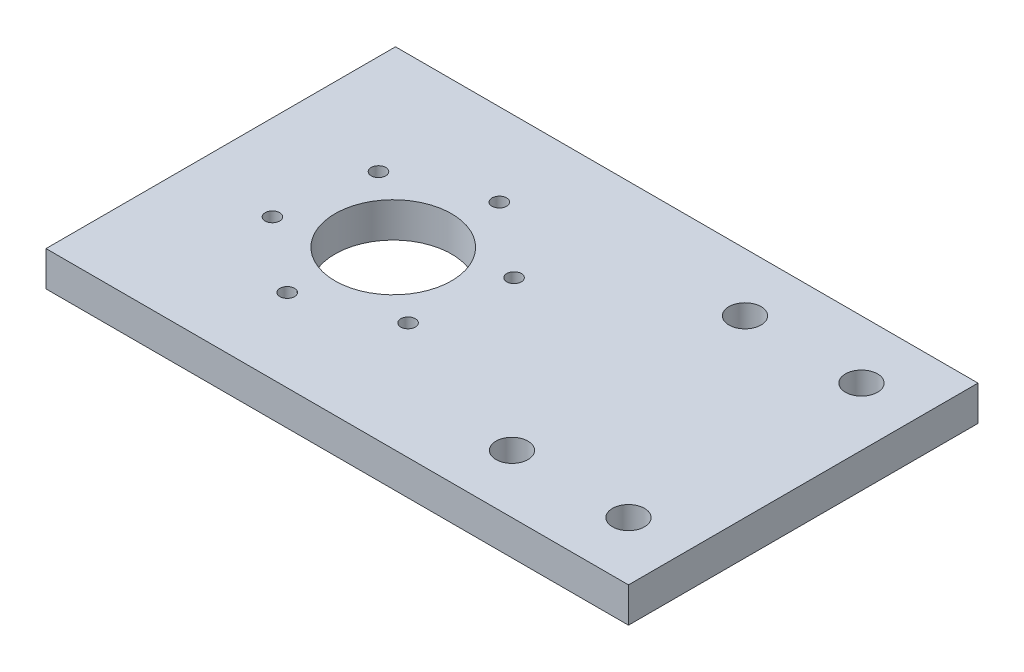
ISO-10303-21;
HEADER;
FILE_DESCRIPTION(('STEP AP214'),'2;1');
FILE_NAME('part.step','',(''),(''),'','','');
FILE_SCHEMA(('AUTOMOTIVE_DESIGN { 1 0 10303 214 1 1 1 1 }'));
ENDSEC;
DATA;
#1=APPLICATION_CONTEXT('core data for automotive mechanical design processes');
#2=APPLICATION_PROTOCOL_DEFINITION('international standard','automotive_design',2000,#1);
#3=PRODUCT_CONTEXT('',#1,'mechanical');
#4=PRODUCT('Part','Part','',(#3));
#5=PRODUCT_RELATED_PRODUCT_CATEGORY('part','',(#4));
#6=PRODUCT_DEFINITION_FORMATION('','',#4);
#7=PRODUCT_DEFINITION_CONTEXT('part definition',#1,'design');
#8=PRODUCT_DEFINITION('design','',#6,#7);
#9=PRODUCT_DEFINITION_SHAPE('','',#8);
#10=(LENGTH_UNIT() NAMED_UNIT(*) SI_UNIT(.MILLI.,.METRE.));
#11=(NAMED_UNIT(*) PLANE_ANGLE_UNIT() SI_UNIT($,.RADIAN.));
#12=(NAMED_UNIT(*) SI_UNIT($,.STERADIAN.) SOLID_ANGLE_UNIT());
#13=UNCERTAINTY_MEASURE_WITH_UNIT(LENGTH_MEASURE(1.E-05),#10,'distance_accuracy_value','');
#14=(GEOMETRIC_REPRESENTATION_CONTEXT(3) GLOBAL_UNCERTAINTY_ASSIGNED_CONTEXT((#13)) GLOBAL_UNIT_ASSIGNED_CONTEXT((#10,
#11,#12)) REPRESENTATION_CONTEXT('',''));
#15=CARTESIAN_POINT('',(0.,0.,0.));
#16=DIRECTION('',(0.,0.,1.));
#17=DIRECTION('',(1.,0.,0.));
#18=AXIS2_PLACEMENT_3D('',#15,#16,#17);
#19=CARTESIAN_POINT('',(0.,6.,0.));
#20=DIRECTION('',(1.,0.,0.));
#21=DIRECTION('',(0.,0.,-1.));
#22=AXIS2_PLACEMENT_3D('',#19,#20,#21);
#23=PLANE('',#22);
#24=DIRECTION('',(0.,0.,1.));
#25=VECTOR('',#24,1.);
#26=CARTESIAN_POINT('',(0.,0.,0.));
#27=LINE('',#26,#25);
#28=CARTESIAN_POINT('',(0.,0.,-60.));
#29=VERTEX_POINT('',#28);
#30=CARTESIAN_POINT('',(0.,0.,0.));
#31=VERTEX_POINT('',#30);
#32=EDGE_CURVE('E105',#29,#31,#27,.T.);
#33=ORIENTED_EDGE('',*,*,#32,.T.);
#34=DIRECTION('',(0.,-1.,0.));
#35=VECTOR('',#34,1.);
#36=CARTESIAN_POINT('',(0.,6.,0.));
#37=LINE('',#36,#35);
#38=CARTESIAN_POINT('',(0.,6.,0.));
#39=VERTEX_POINT('',#38);
#40=EDGE_CURVE('E11',#39,#31,#37,.T.);
#41=ORIENTED_EDGE('',*,*,#40,.F.);
#42=DIRECTION('',(0.,0.,1.));
#43=VECTOR('',#42,1.);
#44=CARTESIAN_POINT('',(0.,6.,0.));
#45=LINE('',#44,#43);
#46=CARTESIAN_POINT('',(0.,6.,-60.));
#47=VERTEX_POINT('',#46);
#48=EDGE_CURVE('E89',#47,#39,#45,.T.);
#49=ORIENTED_EDGE('',*,*,#48,.F.);
#50=DIRECTION('',(0.,-1.,0.));
#51=VECTOR('',#50,1.);
#52=CARTESIAN_POINT('',(0.,6.,-60.));
#53=LINE('',#52,#51);
#54=EDGE_CURVE('E96',#47,#29,#53,.T.);
#55=ORIENTED_EDGE('',*,*,#54,.T.);
#56=EDGE_LOOP('',(#33,#41,#49,#55));
#57=FACE_BOUND('',#56,.T.);
#58=ADVANCED_FACE('F39',(#57),#23,.F.);
#59=CARTESIAN_POINT('',(0.,6.,0.));
#60=DIRECTION('',(0.,0.,-1.));
#61=DIRECTION('',(-1.,0.,0.));
#62=AXIS2_PLACEMENT_3D('',#59,#60,#61);
#63=PLANE('',#62);
#64=DIRECTION('',(1.,0.,0.));
#65=VECTOR('',#64,1.);
#66=CARTESIAN_POINT('',(0.,0.,0.));
#67=LINE('',#66,#65);
#68=CARTESIAN_POINT('',(100.,0.,0.));
#69=VERTEX_POINT('',#68);
#70=EDGE_CURVE('E93',#31,#69,#67,.T.);
#71=ORIENTED_EDGE('',*,*,#70,.T.);
#72=DIRECTION('',(0.,-1.,0.));
#73=VECTOR('',#72,1.);
#74=CARTESIAN_POINT('',(100.,6.,0.));
#75=LINE('',#74,#73);
#76=CARTESIAN_POINT('',(100.,6.,0.));
#77=VERTEX_POINT('',#76);
#78=EDGE_CURVE('E50',#77,#69,#75,.T.);
#79=ORIENTED_EDGE('',*,*,#78,.F.);
#80=DIRECTION('',(1.,0.,0.));
#81=VECTOR('',#80,1.);
#82=CARTESIAN_POINT('',(0.,6.,0.));
#83=LINE('',#82,#81);
#84=EDGE_CURVE('E83',#39,#77,#83,.T.);
#85=ORIENTED_EDGE('',*,*,#84,.F.);
#86=ORIENTED_EDGE('',*,*,#40,.T.);
#87=EDGE_LOOP('',(#71,#79,#85,#86));
#88=FACE_BOUND('',#87,.T.);
#89=ADVANCED_FACE('F94',(#88),#63,.F.);
#90=CARTESIAN_POINT('',(100.,6.,0.));
#91=DIRECTION('',(-1.,0.,0.));
#92=DIRECTION('',(0.,0.,1.));
#93=AXIS2_PLACEMENT_3D('',#90,#91,#92);
#94=PLANE('',#93);
#95=DIRECTION('',(0.,0.,-1.));
#96=VECTOR('',#95,1.);
#97=CARTESIAN_POINT('',(100.,0.,0.));
#98=LINE('',#97,#96);
#99=CARTESIAN_POINT('',(100.,0.,-60.));
#100=VERTEX_POINT('',#99);
#101=EDGE_CURVE('E72',#69,#100,#98,.T.);
#102=ORIENTED_EDGE('',*,*,#101,.T.);
#103=DIRECTION('',(0.,-1.,0.));
#104=VECTOR('',#103,1.);
#105=CARTESIAN_POINT('',(100.,6.,-60.));
#106=LINE('',#105,#104);
#107=CARTESIAN_POINT('',(100.,6.,-60.));
#108=VERTEX_POINT('',#107);
#109=EDGE_CURVE('E95',#108,#100,#106,.T.);
#110=ORIENTED_EDGE('',*,*,#109,.F.);
#111=DIRECTION('',(0.,0.,-1.));
#112=VECTOR('',#111,1.);
#113=CARTESIAN_POINT('',(100.,6.,0.));
#114=LINE('',#113,#112);
#115=EDGE_CURVE('E87',#77,#108,#114,.T.);
#116=ORIENTED_EDGE('',*,*,#115,.F.);
#117=ORIENTED_EDGE('',*,*,#78,.T.);
#118=EDGE_LOOP('',(#102,#110,#116,#117));
#119=FACE_BOUND('',#118,.T.);
#120=ADVANCED_FACE('F98',(#119),#94,.F.);
#121=CARTESIAN_POINT('',(0.,6.,-60.));
#122=DIRECTION('',(0.,0.,1.));
#123=DIRECTION('',(1.,0.,0.));
#124=AXIS2_PLACEMENT_3D('',#121,#122,#123);
#125=PLANE('',#124);
#126=DIRECTION('',(-1.,0.,0.));
#127=VECTOR('',#126,1.);
#128=CARTESIAN_POINT('',(0.,0.,-60.));
#129=LINE('',#128,#127);
#130=EDGE_CURVE('E76',#100,#29,#129,.T.);
#131=ORIENTED_EDGE('',*,*,#130,.T.);
#132=ORIENTED_EDGE('',*,*,#54,.F.);
#133=DIRECTION('',(-1.,0.,0.));
#134=VECTOR('',#133,1.);
#135=CARTESIAN_POINT('',(0.,6.,-60.));
#136=LINE('',#135,#134);
#137=EDGE_CURVE('E54',#108,#47,#136,.T.);
#138=ORIENTED_EDGE('',*,*,#137,.F.);
#139=ORIENTED_EDGE('',*,*,#109,.T.);
#140=EDGE_LOOP('',(#131,#132,#138,#139));
#141=FACE_BOUND('',#140,.T.);
#142=ADVANCED_FACE('F109',(#141),#125,.F.);
#143=CARTESIAN_POINT('',(0.,6.,0.));
#144=DIRECTION('',(0.,-1.,0.));
#145=DIRECTION('',(0.,0.,-1.));
#146=AXIS2_PLACEMENT_3D('',#143,#144,#145);
#147=PLANE('',#146);
#148=CARTESIAN_POINT('',(31.9983830247219,6.,-45.8215394808849));
#149=DIRECTION('',(0.,1.,0.));
#150=DIRECTION('',(0.,0.,1.));
#151=AXIS2_PLACEMENT_3D('',#148,#149,#150);
#152=CIRCLE('',#151,1.24999999999999);
#153=CARTESIAN_POINT('',(31.9983830247219,6.,-44.5715394808849));
#154=VERTEX_POINT('',#153);
#155=EDGE_CURVE('E176',#154,#154,#152,.T.);
#156=ORIENTED_EDGE('',*,*,#155,.F.);
#157=EDGE_LOOP('',(#156));
#158=FACE_BOUND('',#157,.T.);
#159=CARTESIAN_POINT('',(44.5087172174168,6.,-35.8469949606032));
#160=DIRECTION('',(0.,1.,0.));
#161=DIRECTION('',(0.,0.,1.));
#162=AXIS2_PLACEMENT_3D('',#159,#160,#161);
#163=CIRCLE('',#162,1.24999999999999);
#164=CARTESIAN_POINT('',(44.5087172174168,6.,-34.5969949606032));
#165=VERTEX_POINT('',#164);
#166=EDGE_CURVE('E173',#165,#165,#163,.T.);
#167=ORIENTED_EDGE('',*,*,#166,.F.);
#168=EDGE_LOOP('',(#167));
#169=FACE_BOUND('',#168,.T.);
#170=CARTESIAN_POINT('',(42.1256753680215,6.,-20.0254554797552));
#171=DIRECTION('',(0.,1.,0.));
#172=DIRECTION('',(0.,0.,1.));
#173=AXIS2_PLACEMENT_3D('',#170,#171,#172);
#174=CIRCLE('',#173,1.24999999999999);
#175=CARTESIAN_POINT('',(42.1256753680215,6.,-18.7754554797552));
#176=VERTEX_POINT('',#175);
#177=EDGE_CURVE('E170',#176,#176,#174,.T.);
#178=ORIENTED_EDGE('',*,*,#177,.F.);
#179=EDGE_LOOP('',(#178));
#180=FACE_BOUND('',#179,.T.);
#181=CARTESIAN_POINT('',(27.2322993259309,6.,-14.1784605191891));
#182=DIRECTION('',(0.,1.,0.));
#183=DIRECTION('',(0.,0.,1.));
#184=AXIS2_PLACEMENT_3D('',#181,#182,#183);
#185=CIRCLE('',#184,1.24999999999999);
#186=CARTESIAN_POINT('',(27.2322993259309,6.,-12.9284605191891));
#187=VERTEX_POINT('',#186);
#188=EDGE_CURVE('E163',#187,#187,#185,.T.);
#189=ORIENTED_EDGE('',*,*,#188,.F.);
#190=EDGE_LOOP('',(#189));
#191=FACE_BOUND('',#190,.T.);
#192=CARTESIAN_POINT('',(14.7219651332359,6.,-24.153005039471));
#193=DIRECTION('',(0.,1.,0.));
#194=DIRECTION('',(0.,0.,1.));
#195=AXIS2_PLACEMENT_3D('',#192,#193,#194);
#196=CIRCLE('',#195,1.24999999999998);
#197=CARTESIAN_POINT('',(14.7219651332359,6.,-22.903005039471));
#198=VERTEX_POINT('',#197);
#199=EDGE_CURVE('E154',#198,#198,#196,.T.);
#200=ORIENTED_EDGE('',*,*,#199,.F.);
#201=EDGE_LOOP('',(#200));
#202=FACE_BOUND('',#201,.T.);
#203=CARTESIAN_POINT('',(17.1050069826314,6.,-39.9745445203189));
#204=DIRECTION('',(0.,1.,0.));
#205=DIRECTION('',(0.,0.,1.));
#206=AXIS2_PLACEMENT_3D('',#203,#204,#205);
#207=CIRCLE('',#206,1.24999999999999);
#208=CARTESIAN_POINT('',(17.1050069826314,6.,-38.724544520319));
#209=VERTEX_POINT('',#208);
#210=EDGE_CURVE('E146',#209,#209,#207,.T.);
#211=ORIENTED_EDGE('',*,*,#210,.F.);
#212=EDGE_LOOP('',(#211));
#213=FACE_BOUND('',#212,.T.);
#214=CARTESIAN_POINT('',(29.6153411753303,6.,-30.));
#215=DIRECTION('',(0.,1.,0.));
#216=DIRECTION('',(0.,0.,1.));
#217=AXIS2_PLACEMENT_3D('',#214,#215,#216);
#218=CIRCLE('',#217,10.);
#219=CARTESIAN_POINT('',(29.6153411753303,6.,-20.));
#220=VERTEX_POINT('',#219);
#221=EDGE_CURVE('E142',#220,#220,#218,.T.);
#222=ORIENTED_EDGE('',*,*,#221,.F.);
#223=EDGE_LOOP('',(#222));
#224=FACE_BOUND('',#223,.T.);
#225=CARTESIAN_POINT('',(90.,6.,-50.));
#226=DIRECTION('',(0.,1.,0.));
#227=DIRECTION('',(0.,0.,1.));
#228=AXIS2_PLACEMENT_3D('',#225,#226,#227);
#229=CIRCLE('',#228,2.75);
#230=CARTESIAN_POINT('',(90.,6.,-47.25));
#231=VERTEX_POINT('',#230);
#232=EDGE_CURVE('E139',#231,#231,#229,.T.);
#233=ORIENTED_EDGE('',*,*,#232,.F.);
#234=EDGE_LOOP('',(#233));
#235=FACE_BOUND('',#234,.T.);
#236=CARTESIAN_POINT('',(70.,6.,-50.));
#237=DIRECTION('',(0.,1.,0.));
#238=DIRECTION('',(0.,0.,1.));
#239=AXIS2_PLACEMENT_3D('',#236,#237,#238);
#240=CIRCLE('',#239,2.74999999999999);
#241=CARTESIAN_POINT('',(70.,6.,-47.25));
#242=VERTEX_POINT('',#241);
#243=EDGE_CURVE('E135',#242,#242,#240,.T.);
#244=ORIENTED_EDGE('',*,*,#243,.F.);
#245=EDGE_LOOP('',(#244));
#246=FACE_BOUND('',#245,.T.);
#247=CARTESIAN_POINT('',(70.,6.,-10.));
#248=DIRECTION('',(0.,1.,0.));
#249=DIRECTION('',(0.,0.,1.));
#250=AXIS2_PLACEMENT_3D('',#247,#248,#249);
#251=CIRCLE('',#250,2.74999999999999);
#252=CARTESIAN_POINT('',(70.,6.,-7.25000000000002));
#253=VERTEX_POINT('',#252);
#254=EDGE_CURVE('E127',#253,#253,#251,.T.);
#255=ORIENTED_EDGE('',*,*,#254,.F.);
#256=EDGE_LOOP('',(#255));
#257=FACE_BOUND('',#256,.T.);
#258=CARTESIAN_POINT('',(90.,6.,-10.));
#259=DIRECTION('',(0.,1.,0.));
#260=DIRECTION('',(0.,0.,1.));
#261=AXIS2_PLACEMENT_3D('',#258,#259,#260);
#262=CIRCLE('',#261,2.74999999999999);
#263=CARTESIAN_POINT('',(90.,6.,-7.25000000000002));
#264=VERTEX_POINT('',#263);
#265=EDGE_CURVE('E118',#264,#264,#262,.T.);
#266=ORIENTED_EDGE('',*,*,#265,.F.);
#267=EDGE_LOOP('',(#266));
#268=FACE_BOUND('',#267,.T.);
#269=ORIENTED_EDGE('',*,*,#48,.T.);
#270=ORIENTED_EDGE('',*,*,#84,.T.);
#271=ORIENTED_EDGE('',*,*,#115,.T.);
#272=ORIENTED_EDGE('',*,*,#137,.T.);
#273=EDGE_LOOP('',(#269,#270,#271,#272));
#274=FACE_BOUND('',#273,.T.);
#275=ADVANCED_FACE('F86',(#158,#169,#180,#191,#202,#213,#224,#235,#246,#257,#268,#274),#147,.F.);
#276=CARTESIAN_POINT('',(0.,0.,0.));
#277=DIRECTION('',(0.,-1.,0.));
#278=DIRECTION('',(0.,0.,-1.));
#279=AXIS2_PLACEMENT_3D('',#276,#277,#278);
#280=PLANE('',#279);
#281=CARTESIAN_POINT('',(31.9983830247219,0.,-45.8215394808849));
#282=DIRECTION('',(0.,1.,0.));
#283=DIRECTION('',(0.,0.,1.));
#284=AXIS2_PLACEMENT_3D('',#281,#282,#283);
#285=CIRCLE('',#284,1.24999999999999);
#286=CARTESIAN_POINT('',(31.9983830247219,0.,-44.5715394808849));
#287=VERTEX_POINT('',#286);
#288=EDGE_CURVE('E119',#287,#287,#285,.T.);
#289=ORIENTED_EDGE('',*,*,#288,.T.);
#290=EDGE_LOOP('',(#289));
#291=FACE_BOUND('',#290,.T.);
#292=CARTESIAN_POINT('',(44.5087172174168,0.,-35.8469949606032));
#293=DIRECTION('',(0.,1.,0.));
#294=DIRECTION('',(0.,0.,1.));
#295=AXIS2_PLACEMENT_3D('',#292,#293,#294);
#296=CIRCLE('',#295,1.24999999999999);
#297=CARTESIAN_POINT('',(44.5087172174168,0.,-34.5969949606032));
#298=VERTEX_POINT('',#297);
#299=EDGE_CURVE('E167',#298,#298,#296,.T.);
#300=ORIENTED_EDGE('',*,*,#299,.T.);
#301=EDGE_LOOP('',(#300));
#302=FACE_BOUND('',#301,.T.);
#303=CARTESIAN_POINT('',(42.1256753680215,0.,-20.0254554797552));
#304=DIRECTION('',(0.,1.,0.));
#305=DIRECTION('',(0.,0.,1.));
#306=AXIS2_PLACEMENT_3D('',#303,#304,#305);
#307=CIRCLE('',#306,1.24999999999999);
#308=CARTESIAN_POINT('',(42.1256753680215,0.,-18.7754554797552));
#309=VERTEX_POINT('',#308);
#310=EDGE_CURVE('E165',#309,#309,#307,.T.);
#311=ORIENTED_EDGE('',*,*,#310,.T.);
#312=EDGE_LOOP('',(#311));
#313=FACE_BOUND('',#312,.T.);
#314=CARTESIAN_POINT('',(27.2322993259309,0.,-14.1784605191891));
#315=DIRECTION('',(0.,1.,0.));
#316=DIRECTION('',(0.,0.,1.));
#317=AXIS2_PLACEMENT_3D('',#314,#315,#316);
#318=CIRCLE('',#317,1.24999999999999);
#319=CARTESIAN_POINT('',(27.2322993259309,0.,-12.9284605191891));
#320=VERTEX_POINT('',#319);
#321=EDGE_CURVE('E159',#320,#320,#318,.T.);
#322=ORIENTED_EDGE('',*,*,#321,.T.);
#323=EDGE_LOOP('',(#322));
#324=FACE_BOUND('',#323,.T.);
#325=CARTESIAN_POINT('',(14.7219651332359,0.,-24.153005039471));
#326=DIRECTION('',(0.,1.,0.));
#327=DIRECTION('',(0.,0.,1.));
#328=AXIS2_PLACEMENT_3D('',#325,#326,#327);
#329=CIRCLE('',#328,1.24999999999998);
#330=CARTESIAN_POINT('',(14.7219651332359,0.,-22.903005039471));
#331=VERTEX_POINT('',#330);
#332=EDGE_CURVE('E155',#331,#331,#329,.T.);
#333=ORIENTED_EDGE('',*,*,#332,.T.);
#334=EDGE_LOOP('',(#333));
#335=FACE_BOUND('',#334,.T.);
#336=CARTESIAN_POINT('',(17.1050069826314,0.,-39.9745445203189));
#337=DIRECTION('',(0.,1.,0.));
#338=DIRECTION('',(0.,0.,1.));
#339=AXIS2_PLACEMENT_3D('',#336,#337,#338);
#340=CIRCLE('',#339,1.24999999999999);
#341=CARTESIAN_POINT('',(17.1050069826314,0.,-38.724544520319));
#342=VERTEX_POINT('',#341);
#343=EDGE_CURVE('E147',#342,#342,#340,.T.);
#344=ORIENTED_EDGE('',*,*,#343,.T.);
#345=EDGE_LOOP('',(#344));
#346=FACE_BOUND('',#345,.T.);
#347=CARTESIAN_POINT('',(29.6153411753303,0.,-30.));
#348=DIRECTION('',(0.,1.,0.));
#349=DIRECTION('',(0.,0.,1.));
#350=AXIS2_PLACEMENT_3D('',#347,#348,#349);
#351=CIRCLE('',#350,10.);
#352=CARTESIAN_POINT('',(29.6153411753303,0.,-20.));
#353=VERTEX_POINT('',#352);
#354=EDGE_CURVE('E102',#353,#353,#351,.T.);
#355=ORIENTED_EDGE('',*,*,#354,.T.);
#356=EDGE_LOOP('',(#355));
#357=FACE_BOUND('',#356,.T.);
#358=CARTESIAN_POINT('',(90.,0.,-50.));
#359=DIRECTION('',(0.,1.,0.));
#360=DIRECTION('',(0.,0.,1.));
#361=AXIS2_PLACEMENT_3D('',#358,#359,#360);
#362=CIRCLE('',#361,2.75);
#363=CARTESIAN_POINT('',(90.,0.,-47.25));
#364=VERTEX_POINT('',#363);
#365=EDGE_CURVE('E134',#364,#364,#362,.T.);
#366=ORIENTED_EDGE('',*,*,#365,.T.);
#367=EDGE_LOOP('',(#366));
#368=FACE_BOUND('',#367,.T.);
#369=CARTESIAN_POINT('',(70.,0.,-50.));
#370=DIRECTION('',(0.,1.,0.));
#371=DIRECTION('',(0.,0.,1.));
#372=AXIS2_PLACEMENT_3D('',#369,#370,#371);
#373=CIRCLE('',#372,2.74999999999999);
#374=CARTESIAN_POINT('',(70.,0.,-47.25));
#375=VERTEX_POINT('',#374);
#376=EDGE_CURVE('E126',#375,#375,#373,.T.);
#377=ORIENTED_EDGE('',*,*,#376,.T.);
#378=EDGE_LOOP('',(#377));
#379=FACE_BOUND('',#378,.T.);
#380=CARTESIAN_POINT('',(70.,0.,-10.));
#381=DIRECTION('',(0.,1.,0.));
#382=DIRECTION('',(0.,0.,1.));
#383=AXIS2_PLACEMENT_3D('',#380,#381,#382);
#384=CIRCLE('',#383,2.74999999999999);
#385=CARTESIAN_POINT('',(70.,0.,-7.25000000000002));
#386=VERTEX_POINT('',#385);
#387=EDGE_CURVE('E124',#386,#386,#384,.T.);
#388=ORIENTED_EDGE('',*,*,#387,.T.);
#389=EDGE_LOOP('',(#388));
#390=FACE_BOUND('',#389,.T.);
#391=CARTESIAN_POINT('',(90.,0.,-10.));
#392=DIRECTION('',(0.,1.,0.));
#393=DIRECTION('',(0.,0.,1.));
#394=AXIS2_PLACEMENT_3D('',#391,#392,#393);
#395=CIRCLE('',#394,2.74999999999999);
#396=CARTESIAN_POINT('',(90.,0.,-7.25000000000002));
#397=VERTEX_POINT('',#396);
#398=EDGE_CURVE('E116',#397,#397,#395,.T.);
#399=ORIENTED_EDGE('',*,*,#398,.T.);
#400=EDGE_LOOP('',(#399));
#401=FACE_BOUND('',#400,.T.);
#402=ORIENTED_EDGE('',*,*,#32,.F.);
#403=ORIENTED_EDGE('',*,*,#130,.F.);
#404=ORIENTED_EDGE('',*,*,#101,.F.);
#405=ORIENTED_EDGE('',*,*,#70,.F.);
#406=EDGE_LOOP('',(#402,#403,#404,#405));
#407=FACE_BOUND('',#406,.T.);
#408=ADVANCED_FACE('F113',(#291,#302,#313,#324,#335,#346,#357,#368,#379,#390,#401,#407),#280,.T.);
#409=CARTESIAN_POINT('',(90.,0.,-10.));
#410=DIRECTION('',(0.,1.,0.));
#411=DIRECTION('',(0.,0.,1.));
#412=AXIS2_PLACEMENT_3D('',#409,#410,#411);
#413=CYLINDRICAL_SURFACE('',#412,2.74999999999999);
#414=ORIENTED_EDGE('',*,*,#398,.F.);
#415=EDGE_LOOP('',(#414));
#416=FACE_BOUND('',#415,.T.);
#417=ORIENTED_EDGE('',*,*,#265,.T.);
#418=EDGE_LOOP('',(#417));
#419=FACE_BOUND('',#418,.T.);
#420=ADVANCED_FACE('F211',(#416,#419),#413,.F.);
#421=CARTESIAN_POINT('',(70.,0.,-10.));
#422=DIRECTION('',(0.,1.,0.));
#423=DIRECTION('',(0.,0.,1.));
#424=AXIS2_PLACEMENT_3D('',#421,#422,#423);
#425=CYLINDRICAL_SURFACE('',#424,2.74999999999999);
#426=ORIENTED_EDGE('',*,*,#387,.F.);
#427=EDGE_LOOP('',(#426));
#428=FACE_BOUND('',#427,.T.);
#429=ORIENTED_EDGE('',*,*,#254,.T.);
#430=EDGE_LOOP('',(#429));
#431=FACE_BOUND('',#430,.T.);
#432=ADVANCED_FACE('F216',(#428,#431),#425,.F.);
#433=CARTESIAN_POINT('',(70.,0.,-50.));
#434=DIRECTION('',(0.,1.,0.));
#435=DIRECTION('',(0.,0.,1.));
#436=AXIS2_PLACEMENT_3D('',#433,#434,#435);
#437=CYLINDRICAL_SURFACE('',#436,2.74999999999999);
#438=ORIENTED_EDGE('',*,*,#376,.F.);
#439=EDGE_LOOP('',(#438));
#440=FACE_BOUND('',#439,.T.);
#441=ORIENTED_EDGE('',*,*,#243,.T.);
#442=EDGE_LOOP('',(#441));
#443=FACE_BOUND('',#442,.T.);
#444=ADVANCED_FACE('F224',(#440,#443),#437,.F.);
#445=CARTESIAN_POINT('',(90.,0.,-50.));
#446=DIRECTION('',(0.,1.,0.));
#447=DIRECTION('',(0.,0.,1.));
#448=AXIS2_PLACEMENT_3D('',#445,#446,#447);
#449=CYLINDRICAL_SURFACE('',#448,2.75);
#450=ORIENTED_EDGE('',*,*,#365,.F.);
#451=EDGE_LOOP('',(#450));
#452=FACE_BOUND('',#451,.T.);
#453=ORIENTED_EDGE('',*,*,#232,.T.);
#454=EDGE_LOOP('',(#453));
#455=FACE_BOUND('',#454,.T.);
#456=ADVANCED_FACE('F285',(#452,#455),#449,.F.);
#457=CARTESIAN_POINT('',(29.6153411753303,0.,-30.));
#458=DIRECTION('',(0.,1.,0.));
#459=DIRECTION('',(0.,0.,1.));
#460=AXIS2_PLACEMENT_3D('',#457,#458,#459);
#461=CYLINDRICAL_SURFACE('',#460,10.);
#462=ORIENTED_EDGE('',*,*,#354,.F.);
#463=EDGE_LOOP('',(#462));
#464=FACE_BOUND('',#463,.T.);
#465=ORIENTED_EDGE('',*,*,#221,.T.);
#466=EDGE_LOOP('',(#465));
#467=FACE_BOUND('',#466,.T.);
#468=ADVANCED_FACE('F293',(#464,#467),#461,.F.);
#469=CARTESIAN_POINT('',(17.1050069826314,0.,-39.9745445203189));
#470=DIRECTION('',(0.,1.,0.));
#471=DIRECTION('',(0.,0.,1.));
#472=AXIS2_PLACEMENT_3D('',#469,#470,#471);
#473=CYLINDRICAL_SURFACE('',#472,1.24999999999999);
#474=ORIENTED_EDGE('',*,*,#343,.F.);
#475=EDGE_LOOP('',(#474));
#476=FACE_BOUND('',#475,.T.);
#477=ORIENTED_EDGE('',*,*,#210,.T.);
#478=EDGE_LOOP('',(#477));
#479=FACE_BOUND('',#478,.T.);
#480=ADVANCED_FACE('F297',(#476,#479),#473,.F.);
#481=CARTESIAN_POINT('',(14.7219651332359,0.,-24.153005039471));
#482=DIRECTION('',(0.,1.,0.));
#483=DIRECTION('',(0.,0.,1.));
#484=AXIS2_PLACEMENT_3D('',#481,#482,#483);
#485=CYLINDRICAL_SURFACE('',#484,1.24999999999998);
#486=ORIENTED_EDGE('',*,*,#332,.F.);
#487=EDGE_LOOP('',(#486));
#488=FACE_BOUND('',#487,.T.);
#489=ORIENTED_EDGE('',*,*,#199,.T.);
#490=EDGE_LOOP('',(#489));
#491=FACE_BOUND('',#490,.T.);
#492=ADVANCED_FACE('F307',(#488,#491),#485,.F.);
#493=CARTESIAN_POINT('',(27.2322993259309,0.,-14.1784605191891));
#494=DIRECTION('',(0.,1.,0.));
#495=DIRECTION('',(0.,0.,1.));
#496=AXIS2_PLACEMENT_3D('',#493,#494,#495);
#497=CYLINDRICAL_SURFACE('',#496,1.24999999999999);
#498=ORIENTED_EDGE('',*,*,#321,.F.);
#499=EDGE_LOOP('',(#498));
#500=FACE_BOUND('',#499,.T.);
#501=ORIENTED_EDGE('',*,*,#188,.T.);
#502=EDGE_LOOP('',(#501));
#503=FACE_BOUND('',#502,.T.);
#504=ADVANCED_FACE('F319',(#500,#503),#497,.F.);
#505=CARTESIAN_POINT('',(42.1256753680215,0.,-20.0254554797552));
#506=DIRECTION('',(0.,1.,0.));
#507=DIRECTION('',(0.,0.,1.));
#508=AXIS2_PLACEMENT_3D('',#505,#506,#507);
#509=CYLINDRICAL_SURFACE('',#508,1.24999999999999);
#510=ORIENTED_EDGE('',*,*,#310,.F.);
#511=EDGE_LOOP('',(#510));
#512=FACE_BOUND('',#511,.T.);
#513=ORIENTED_EDGE('',*,*,#177,.T.);
#514=EDGE_LOOP('',(#513));
#515=FACE_BOUND('',#514,.T.);
#516=ADVANCED_FACE('F330',(#512,#515),#509,.F.);
#517=CARTESIAN_POINT('',(44.5087172174168,0.,-35.8469949606032));
#518=DIRECTION('',(0.,1.,0.));
#519=DIRECTION('',(0.,0.,1.));
#520=AXIS2_PLACEMENT_3D('',#517,#518,#519);
#521=CYLINDRICAL_SURFACE('',#520,1.24999999999999);
#522=ORIENTED_EDGE('',*,*,#299,.F.);
#523=EDGE_LOOP('',(#522));
#524=FACE_BOUND('',#523,.T.);
#525=ORIENTED_EDGE('',*,*,#166,.T.);
#526=EDGE_LOOP('',(#525));
#527=FACE_BOUND('',#526,.T.);
#528=ADVANCED_FACE('F190',(#524,#527),#521,.F.);
#529=CARTESIAN_POINT('',(31.9983830247219,0.,-45.8215394808849));
#530=DIRECTION('',(0.,1.,0.));
#531=DIRECTION('',(0.,0.,1.));
#532=AXIS2_PLACEMENT_3D('',#529,#530,#531);
#533=CYLINDRICAL_SURFACE('',#532,1.24999999999999);
#534=ORIENTED_EDGE('',*,*,#288,.F.);
#535=EDGE_LOOP('',(#534));
#536=FACE_BOUND('',#535,.T.);
#537=ORIENTED_EDGE('',*,*,#155,.T.);
#538=EDGE_LOOP('',(#537));
#539=FACE_BOUND('',#538,.T.);
#540=ADVANCED_FACE('F183',(#536,#539),#533,.F.);
#541=CLOSED_SHELL('',(#58,#89,#120,#142,#275,#408,#420,#432,#444,#456,#468,#480,#492,#504,#516,
#528,#540));
#542=MANIFOLD_SOLID_BREP('B2',#541);
#543=ADVANCED_BREP_SHAPE_REPRESENTATION('',(#18,#542),#14);
#544=SHAPE_DEFINITION_REPRESENTATION(#9,#543);
ENDSEC;
END-ISO-10303-21;
